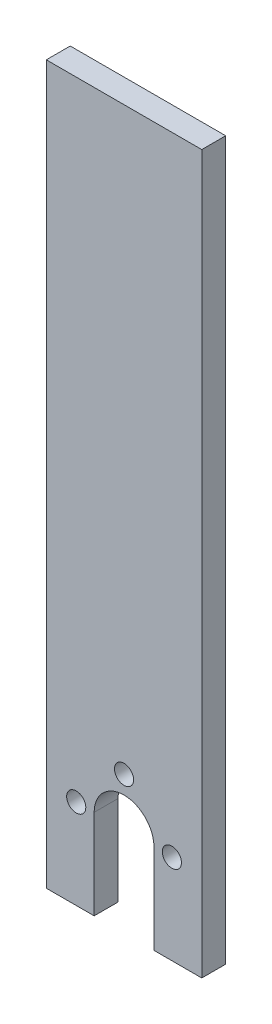
ISO-10303-21;
HEADER;
FILE_DESCRIPTION(('STEP AP214'),'2;1');
FILE_NAME('part.step','',(''),(''),'','','');
FILE_SCHEMA(('AUTOMOTIVE_DESIGN { 1 0 10303 214 1 1 1 1 }'));
ENDSEC;
DATA;
#1=APPLICATION_CONTEXT('core data for automotive mechanical design processes');
#2=APPLICATION_PROTOCOL_DEFINITION('international standard','automotive_design',2000,#1);
#3=PRODUCT_CONTEXT('',#1,'mechanical');
#4=PRODUCT('Part','Part','',(#3));
#5=PRODUCT_RELATED_PRODUCT_CATEGORY('part','',(#4));
#6=PRODUCT_DEFINITION_FORMATION('','',#4);
#7=PRODUCT_DEFINITION_CONTEXT('part definition',#1,'design');
#8=PRODUCT_DEFINITION('design','',#6,#7);
#9=PRODUCT_DEFINITION_SHAPE('','',#8);
#10=(LENGTH_UNIT() NAMED_UNIT(*) SI_UNIT(.MILLI.,.METRE.));
#11=(NAMED_UNIT(*) PLANE_ANGLE_UNIT() SI_UNIT($,.RADIAN.));
#12=(NAMED_UNIT(*) SI_UNIT($,.STERADIAN.) SOLID_ANGLE_UNIT());
#13=UNCERTAINTY_MEASURE_WITH_UNIT(LENGTH_MEASURE(1.E-05),#10,'distance_accuracy_value','');
#14=(GEOMETRIC_REPRESENTATION_CONTEXT(3) GLOBAL_UNCERTAINTY_ASSIGNED_CONTEXT((#13)) GLOBAL_UNIT_ASSIGNED_CONTEXT((#10,
#11,#12)) REPRESENTATION_CONTEXT('',''));
#15=CARTESIAN_POINT('',(0.,0.,0.));
#16=DIRECTION('',(0.,0.,1.));
#17=DIRECTION('',(1.,0.,0.));
#18=AXIS2_PLACEMENT_3D('',#15,#16,#17);
#19=CARTESIAN_POINT('',(0.,0.,4.));
#20=DIRECTION('',(0.,0.,1.));
#21=DIRECTION('',(1.,0.,0.));
#22=AXIS2_PLACEMENT_3D('',#19,#20,#21);
#23=PLANE('',#22);
#24=CARTESIAN_POINT('',(-8.,0.,4.));
#25=DIRECTION('',(0.,0.,1.));
#26=DIRECTION('',(-1.,0.,0.));
#27=AXIS2_PLACEMENT_3D('',#24,#25,#26);
#28=CIRCLE('',#27,1.6);
#29=CARTESIAN_POINT('',(-9.6,0.,4.));
#30=VERTEX_POINT('',#29);
#31=EDGE_CURVE('E187',#30,#30,#28,.T.);
#32=ORIENTED_EDGE('',*,*,#31,.F.);
#33=EDGE_LOOP('',(#32));
#34=FACE_BOUND('',#33,.T.);
#35=DIRECTION('',(1.,0.,0.));
#36=VECTOR('',#35,1.);
#37=CARTESIAN_POINT('',(-5.,-15.,4.));
#38=LINE('',#37,#36);
#39=CARTESIAN_POINT('',(-13.,-15.,4.));
#40=VERTEX_POINT('',#39);
#41=CARTESIAN_POINT('',(-5.,-15.,4.));
#42=VERTEX_POINT('',#41);
#43=EDGE_CURVE('E152',#40,#42,#38,.T.);
#44=ORIENTED_EDGE('',*,*,#43,.T.);
#45=DIRECTION('',(0.,1.,0.));
#46=VECTOR('',#45,1.);
#47=CARTESIAN_POINT('',(-5.,0.,4.));
#48=LINE('',#47,#46);
#49=CARTESIAN_POINT('',(-5.,0.,4.));
#50=VERTEX_POINT('',#49);
#51=EDGE_CURVE('E95',#42,#50,#48,.T.);
#52=ORIENTED_EDGE('',*,*,#51,.T.);
#53=CARTESIAN_POINT('',(0.,0.,4.));
#54=DIRECTION('',(0.,0.,-1.));
#55=DIRECTION('',(1.,0.,0.));
#56=AXIS2_PLACEMENT_3D('',#53,#54,#55);
#57=CIRCLE('',#56,5.);
#58=CARTESIAN_POINT('',(5.,0.,4.));
#59=VERTEX_POINT('',#58);
#60=EDGE_CURVE('E167',#50,#59,#57,.T.);
#61=ORIENTED_EDGE('',*,*,#60,.T.);
#62=DIRECTION('',(0.,-1.,0.));
#63=VECTOR('',#62,1.);
#64=CARTESIAN_POINT('',(5.,0.,4.));
#65=LINE('',#64,#63);
#66=CARTESIAN_POINT('',(5.,-15.,4.));
#67=VERTEX_POINT('',#66);
#68=EDGE_CURVE('E178',#59,#67,#65,.T.);
#69=ORIENTED_EDGE('',*,*,#68,.T.);
#70=DIRECTION('',(1.,0.,0.));
#71=VECTOR('',#70,1.);
#72=CARTESIAN_POINT('',(5.,-15.,4.));
#73=LINE('',#72,#71);
#74=CARTESIAN_POINT('',(13.,-15.,4.));
#75=VERTEX_POINT('',#74);
#76=EDGE_CURVE('E115',#67,#75,#73,.T.);
#77=ORIENTED_EDGE('',*,*,#76,.T.);
#78=DIRECTION('',(0.,1.,0.));
#79=VECTOR('',#78,1.);
#80=CARTESIAN_POINT('',(13.,-15.,4.));
#81=LINE('',#80,#79);
#82=CARTESIAN_POINT('',(13.,105.,4.));
#83=VERTEX_POINT('',#82);
#84=EDGE_CURVE('E108',#75,#83,#81,.T.);
#85=ORIENTED_EDGE('',*,*,#84,.T.);
#86=DIRECTION('',(-1.,0.,0.));
#87=VECTOR('',#86,1.);
#88=CARTESIAN_POINT('',(13.,105.,4.));
#89=LINE('',#88,#87);
#90=CARTESIAN_POINT('',(-13.,105.,4.));
#91=VERTEX_POINT('',#90);
#92=EDGE_CURVE('E112',#83,#91,#89,.T.);
#93=ORIENTED_EDGE('',*,*,#92,.T.);
#94=DIRECTION('',(0.,-1.,0.));
#95=VECTOR('',#94,1.);
#96=CARTESIAN_POINT('',(-13.,-12.,4.));
#97=LINE('',#96,#95);
#98=EDGE_CURVE('E54',#91,#40,#97,.T.);
#99=ORIENTED_EDGE('',*,*,#98,.T.);
#100=EDGE_LOOP('',(#44,#52,#61,#69,#77,#85,#93,#99));
#101=FACE_BOUND('',#100,.T.);
#102=CARTESIAN_POINT('',(8.,0.,4.));
#103=DIRECTION('',(0.,0.,1.));
#104=DIRECTION('',(1.,0.,0.));
#105=AXIS2_PLACEMENT_3D('',#102,#103,#104);
#106=CIRCLE('',#105,1.6);
#107=CARTESIAN_POINT('',(9.6,0.,4.));
#108=VERTEX_POINT('',#107);
#109=EDGE_CURVE('E138',#108,#108,#106,.T.);
#110=ORIENTED_EDGE('',*,*,#109,.F.);
#111=EDGE_LOOP('',(#110));
#112=FACE_BOUND('',#111,.T.);
#113=CARTESIAN_POINT('',(0.,8.,4.));
#114=DIRECTION('',(0.,0.,1.));
#115=DIRECTION('',(1.,0.,0.));
#116=AXIS2_PLACEMENT_3D('',#113,#114,#115);
#117=CIRCLE('',#116,1.6);
#118=CARTESIAN_POINT('',(1.6,8.,4.));
#119=VERTEX_POINT('',#118);
#120=EDGE_CURVE('E193',#119,#119,#117,.T.);
#121=ORIENTED_EDGE('',*,*,#120,.F.);
#122=EDGE_LOOP('',(#121));
#123=FACE_BOUND('',#122,.T.);
#124=ADVANCED_FACE('F37',(#34,#101,#112,#123),#23,.T.);
#125=CARTESIAN_POINT('',(0.,0.,0.));
#126=DIRECTION('',(0.,0.,1.));
#127=DIRECTION('',(1.,0.,0.));
#128=AXIS2_PLACEMENT_3D('',#125,#126,#127);
#129=PLANE('',#128);
#130=DIRECTION('',(0.,1.,0.));
#131=VECTOR('',#130,1.);
#132=CARTESIAN_POINT('',(-5.,0.,0.));
#133=LINE('',#132,#131);
#134=CARTESIAN_POINT('',(-5.,-15.,0.));
#135=VERTEX_POINT('',#134);
#136=CARTESIAN_POINT('',(-5.,0.,0.));
#137=VERTEX_POINT('',#136);
#138=EDGE_CURVE('E135',#135,#137,#133,.T.);
#139=ORIENTED_EDGE('',*,*,#138,.F.);
#140=DIRECTION('',(1.,0.,0.));
#141=VECTOR('',#140,1.);
#142=CARTESIAN_POINT('',(-8.,-15.,0.));
#143=LINE('',#142,#141);
#144=CARTESIAN_POINT('',(-13.,-15.,0.));
#145=VERTEX_POINT('',#144);
#146=EDGE_CURVE('E150',#145,#135,#143,.T.);
#147=ORIENTED_EDGE('',*,*,#146,.F.);
#148=DIRECTION('',(0.,-1.,0.));
#149=VECTOR('',#148,1.);
#150=CARTESIAN_POINT('',(-13.,-15.,0.));
#151=LINE('',#150,#149);
#152=CARTESIAN_POINT('',(-13.,105.,0.));
#153=VERTEX_POINT('',#152);
#154=EDGE_CURVE('E82',#153,#145,#151,.T.);
#155=ORIENTED_EDGE('',*,*,#154,.F.);
#156=DIRECTION('',(-1.,0.,0.));
#157=VECTOR('',#156,1.);
#158=CARTESIAN_POINT('',(-13.,105.,0.));
#159=LINE('',#158,#157);
#160=CARTESIAN_POINT('',(13.,105.,0.));
#161=VERTEX_POINT('',#160);
#162=EDGE_CURVE('E147',#161,#153,#159,.T.);
#163=ORIENTED_EDGE('',*,*,#162,.F.);
#164=DIRECTION('',(0.,1.,0.));
#165=VECTOR('',#164,1.);
#166=CARTESIAN_POINT('',(13.,-12.,0.));
#167=LINE('',#166,#165);
#168=CARTESIAN_POINT('',(13.,-15.,0.));
#169=VERTEX_POINT('',#168);
#170=EDGE_CURVE('E124',#169,#161,#167,.T.);
#171=ORIENTED_EDGE('',*,*,#170,.F.);
#172=DIRECTION('',(1.,0.,0.));
#173=VECTOR('',#172,1.);
#174=CARTESIAN_POINT('',(8.,-15.,0.));
#175=LINE('',#174,#173);
#176=CARTESIAN_POINT('',(5.,-15.,0.));
#177=VERTEX_POINT('',#176);
#178=EDGE_CURVE('E143',#177,#169,#175,.T.);
#179=ORIENTED_EDGE('',*,*,#178,.F.);
#180=DIRECTION('',(0.,-1.,0.));
#181=VECTOR('',#180,1.);
#182=CARTESIAN_POINT('',(5.,0.,0.));
#183=LINE('',#182,#181);
#184=CARTESIAN_POINT('',(5.,0.,0.));
#185=VERTEX_POINT('',#184);
#186=EDGE_CURVE('E140',#185,#177,#183,.T.);
#187=ORIENTED_EDGE('',*,*,#186,.F.);
#188=CARTESIAN_POINT('',(0.,0.,0.));
#189=DIRECTION('',(0.,0.,-1.));
#190=DIRECTION('',(1.,0.,0.));
#191=AXIS2_PLACEMENT_3D('',#188,#189,#190);
#192=CIRCLE('',#191,5.);
#193=EDGE_CURVE('E137',#137,#185,#192,.T.);
#194=ORIENTED_EDGE('',*,*,#193,.F.);
#195=EDGE_LOOP('',(#139,#147,#155,#163,#171,#179,#187,#194));
#196=FACE_BOUND('',#195,.T.);
#197=CARTESIAN_POINT('',(8.,0.,0.));
#198=DIRECTION('',(0.,0.,1.));
#199=DIRECTION('',(1.,0.,0.));
#200=AXIS2_PLACEMENT_3D('',#197,#198,#199);
#201=CIRCLE('',#200,1.6);
#202=CARTESIAN_POINT('',(9.6,0.,0.));
#203=VERTEX_POINT('',#202);
#204=EDGE_CURVE('E184',#203,#203,#201,.T.);
#205=ORIENTED_EDGE('',*,*,#204,.T.);
#206=EDGE_LOOP('',(#205));
#207=FACE_BOUND('',#206,.T.);
#208=CARTESIAN_POINT('',(-8.,0.,0.));
#209=DIRECTION('',(0.,0.,1.));
#210=DIRECTION('',(-1.,0.,0.));
#211=AXIS2_PLACEMENT_3D('',#208,#209,#210);
#212=CIRCLE('',#211,1.6);
#213=CARTESIAN_POINT('',(-9.6,0.,0.));
#214=VERTEX_POINT('',#213);
#215=EDGE_CURVE('E190',#214,#214,#212,.T.);
#216=ORIENTED_EDGE('',*,*,#215,.T.);
#217=EDGE_LOOP('',(#216));
#218=FACE_BOUND('',#217,.T.);
#219=CARTESIAN_POINT('',(0.,8.,0.));
#220=DIRECTION('',(0.,0.,1.));
#221=DIRECTION('',(1.,0.,0.));
#222=AXIS2_PLACEMENT_3D('',#219,#220,#221);
#223=CIRCLE('',#222,1.6);
#224=CARTESIAN_POINT('',(1.6,8.,0.));
#225=VERTEX_POINT('',#224);
#226=EDGE_CURVE('E196',#225,#225,#223,.T.);
#227=ORIENTED_EDGE('',*,*,#226,.T.);
#228=EDGE_LOOP('',(#227));
#229=FACE_BOUND('',#228,.T.);
#230=ADVANCED_FACE('F170',(#196,#207,#218,#229),#129,.F.);
#231=CARTESIAN_POINT('',(-5.,0.,4.));
#232=DIRECTION('',(-1.,0.,0.));
#233=DIRECTION('',(0.,0.,1.));
#234=AXIS2_PLACEMENT_3D('',#231,#232,#233);
#235=PLANE('',#234);
#236=ORIENTED_EDGE('',*,*,#138,.T.);
#237=DIRECTION('',(0.,0.,-1.));
#238=VECTOR('',#237,1.);
#239=CARTESIAN_POINT('',(-5.,0.,4.));
#240=LINE('',#239,#238);
#241=EDGE_CURVE('E46',#50,#137,#240,.T.);
#242=ORIENTED_EDGE('',*,*,#241,.F.);
#243=ORIENTED_EDGE('',*,*,#51,.F.);
#244=DIRECTION('',(0.,0.,-1.));
#245=VECTOR('',#244,1.);
#246=CARTESIAN_POINT('',(-5.,-15.,4.));
#247=LINE('',#246,#245);
#248=EDGE_CURVE('E11',#42,#135,#247,.T.);
#249=ORIENTED_EDGE('',*,*,#248,.T.);
#250=EDGE_LOOP('',(#236,#242,#243,#249));
#251=FACE_BOUND('',#250,.T.);
#252=ADVANCED_FACE('F39',(#251),#235,.F.);
#253=CARTESIAN_POINT('',(0.,0.,4.));
#254=DIRECTION('',(0.,0.,-1.));
#255=DIRECTION('',(-1.,0.,0.));
#256=AXIS2_PLACEMENT_3D('',#253,#254,#255);
#257=CYLINDRICAL_SURFACE('',#256,5.);
#258=ORIENTED_EDGE('',*,*,#193,.T.);
#259=DIRECTION('',(0.,0.,-1.));
#260=VECTOR('',#259,1.);
#261=CARTESIAN_POINT('',(5.,0.,4.));
#262=LINE('',#261,#260);
#263=EDGE_CURVE('E159',#59,#185,#262,.T.);
#264=ORIENTED_EDGE('',*,*,#263,.F.);
#265=ORIENTED_EDGE('',*,*,#60,.F.);
#266=ORIENTED_EDGE('',*,*,#241,.T.);
#267=EDGE_LOOP('',(#258,#264,#265,#266));
#268=FACE_BOUND('',#267,.T.);
#269=ADVANCED_FACE('F165',(#268),#257,.F.);
#270=CARTESIAN_POINT('',(5.,0.,4.));
#271=DIRECTION('',(1.,0.,0.));
#272=DIRECTION('',(0.,0.,-1.));
#273=AXIS2_PLACEMENT_3D('',#270,#271,#272);
#274=PLANE('',#273);
#275=ORIENTED_EDGE('',*,*,#186,.T.);
#276=DIRECTION('',(0.,0.,-1.));
#277=VECTOR('',#276,1.);
#278=CARTESIAN_POINT('',(5.,-15.,4.));
#279=LINE('',#278,#277);
#280=EDGE_CURVE('E156',#67,#177,#279,.T.);
#281=ORIENTED_EDGE('',*,*,#280,.F.);
#282=ORIENTED_EDGE('',*,*,#68,.F.);
#283=ORIENTED_EDGE('',*,*,#263,.T.);
#284=EDGE_LOOP('',(#275,#281,#282,#283));
#285=FACE_BOUND('',#284,.T.);
#286=ADVANCED_FACE('F174',(#285),#274,.F.);
#287=CARTESIAN_POINT('',(8.,-15.,4.));
#288=DIRECTION('',(0.,1.,0.));
#289=DIRECTION('',(-1.,0.,0.));
#290=AXIS2_PLACEMENT_3D('',#287,#288,#289);
#291=PLANE('',#290);
#292=ORIENTED_EDGE('',*,*,#178,.T.);
#293=DIRECTION('',(0.,0.,-1.));
#294=VECTOR('',#293,1.);
#295=CARTESIAN_POINT('',(13.,-15.,4.));
#296=LINE('',#295,#294);
#297=EDGE_CURVE('E126',#75,#169,#296,.T.);
#298=ORIENTED_EDGE('',*,*,#297,.F.);
#299=ORIENTED_EDGE('',*,*,#76,.F.);
#300=ORIENTED_EDGE('',*,*,#280,.T.);
#301=EDGE_LOOP('',(#292,#298,#299,#300));
#302=FACE_BOUND('',#301,.T.);
#303=ADVANCED_FACE('F177',(#302),#291,.F.);
#304=CARTESIAN_POINT('',(13.,-12.,4.));
#305=DIRECTION('',(-1.,0.,0.));
#306=DIRECTION('',(0.,0.,1.));
#307=AXIS2_PLACEMENT_3D('',#304,#305,#306);
#308=PLANE('',#307);
#309=ORIENTED_EDGE('',*,*,#170,.T.);
#310=DIRECTION('',(0.,0.,-1.));
#311=VECTOR('',#310,1.);
#312=CARTESIAN_POINT('',(13.,105.,4.));
#313=LINE('',#312,#311);
#314=EDGE_CURVE('E122',#83,#161,#313,.T.);
#315=ORIENTED_EDGE('',*,*,#314,.F.);
#316=ORIENTED_EDGE('',*,*,#84,.F.);
#317=ORIENTED_EDGE('',*,*,#297,.T.);
#318=EDGE_LOOP('',(#309,#315,#316,#317));
#319=FACE_BOUND('',#318,.T.);
#320=ADVANCED_FACE('F123',(#319),#308,.F.);
#321=CARTESIAN_POINT('',(-13.,105.,4.));
#322=DIRECTION('',(0.,-1.,0.));
#323=DIRECTION('',(0.,0.,-1.));
#324=AXIS2_PLACEMENT_3D('',#321,#322,#323);
#325=PLANE('',#324);
#326=ORIENTED_EDGE('',*,*,#162,.T.);
#327=DIRECTION('',(0.,0.,-1.));
#328=VECTOR('',#327,1.);
#329=CARTESIAN_POINT('',(-13.,105.,4.));
#330=LINE('',#329,#328);
#331=EDGE_CURVE('E127',#91,#153,#330,.T.);
#332=ORIENTED_EDGE('',*,*,#331,.F.);
#333=ORIENTED_EDGE('',*,*,#92,.F.);
#334=ORIENTED_EDGE('',*,*,#314,.T.);
#335=EDGE_LOOP('',(#326,#332,#333,#334));
#336=FACE_BOUND('',#335,.T.);
#337=ADVANCED_FACE('F129',(#336),#325,.F.);
#338=CARTESIAN_POINT('',(-13.,-15.,4.));
#339=DIRECTION('',(1.,0.,0.));
#340=DIRECTION('',(0.,0.,-1.));
#341=AXIS2_PLACEMENT_3D('',#338,#339,#340);
#342=PLANE('',#341);
#343=ORIENTED_EDGE('',*,*,#154,.T.);
#344=DIRECTION('',(0.,0.,-1.));
#345=VECTOR('',#344,1.);
#346=CARTESIAN_POINT('',(-13.,-15.,4.));
#347=LINE('',#346,#345);
#348=EDGE_CURVE('E131',#40,#145,#347,.T.);
#349=ORIENTED_EDGE('',*,*,#348,.F.);
#350=ORIENTED_EDGE('',*,*,#98,.F.);
#351=ORIENTED_EDGE('',*,*,#331,.T.);
#352=EDGE_LOOP('',(#343,#349,#350,#351));
#353=FACE_BOUND('',#352,.T.);
#354=ADVANCED_FACE('F220',(#353),#342,.F.);
#355=CARTESIAN_POINT('',(-8.,-15.,4.));
#356=DIRECTION('',(0.,1.,0.));
#357=DIRECTION('',(-1.,0.,0.));
#358=AXIS2_PLACEMENT_3D('',#355,#356,#357);
#359=PLANE('',#358);
#360=ORIENTED_EDGE('',*,*,#146,.T.);
#361=ORIENTED_EDGE('',*,*,#248,.F.);
#362=ORIENTED_EDGE('',*,*,#43,.F.);
#363=ORIENTED_EDGE('',*,*,#348,.T.);
#364=EDGE_LOOP('',(#360,#361,#362,#363));
#365=FACE_BOUND('',#364,.T.);
#366=ADVANCED_FACE('F217',(#365),#359,.F.);
#367=CARTESIAN_POINT('',(8.,0.,4.));
#368=DIRECTION('',(0.,0.,-1.));
#369=DIRECTION('',(-1.,0.,0.));
#370=AXIS2_PLACEMENT_3D('',#367,#368,#369);
#371=CYLINDRICAL_SURFACE('',#370,1.6);
#372=ORIENTED_EDGE('',*,*,#109,.T.);
#373=EDGE_LOOP('',(#372));
#374=FACE_BOUND('',#373,.T.);
#375=ORIENTED_EDGE('',*,*,#204,.F.);
#376=EDGE_LOOP('',(#375));
#377=FACE_BOUND('',#376,.T.);
#378=ADVANCED_FACE('F214',(#374,#377),#371,.F.);
#379=CARTESIAN_POINT('',(-8.,0.,4.));
#380=DIRECTION('',(0.,0.,-1.));
#381=DIRECTION('',(-1.,0.,0.));
#382=AXIS2_PLACEMENT_3D('',#379,#380,#381);
#383=CYLINDRICAL_SURFACE('',#382,1.6);
#384=ORIENTED_EDGE('',*,*,#31,.T.);
#385=EDGE_LOOP('',(#384));
#386=FACE_BOUND('',#385,.T.);
#387=ORIENTED_EDGE('',*,*,#215,.F.);
#388=EDGE_LOOP('',(#387));
#389=FACE_BOUND('',#388,.T.);
#390=ADVANCED_FACE('F305',(#386,#389),#383,.F.);
#391=CARTESIAN_POINT('',(0.,8.,4.));
#392=DIRECTION('',(0.,0.,-1.));
#393=DIRECTION('',(-1.,0.,0.));
#394=AXIS2_PLACEMENT_3D('',#391,#392,#393);
#395=CYLINDRICAL_SURFACE('',#394,1.6);
#396=ORIENTED_EDGE('',*,*,#120,.T.);
#397=EDGE_LOOP('',(#396));
#398=FACE_BOUND('',#397,.T.);
#399=ORIENTED_EDGE('',*,*,#226,.F.);
#400=EDGE_LOOP('',(#399));
#401=FACE_BOUND('',#400,.T.);
#402=ADVANCED_FACE('F202',(#398,#401),#395,.F.);
#403=CLOSED_SHELL('',(#124,#230,#252,#269,#286,#303,#320,#337,#354,#366,#378,#390,#402));
#404=MANIFOLD_SOLID_BREP('B2',#403);
#405=ADVANCED_BREP_SHAPE_REPRESENTATION('',(#18,#404),#14);
#406=SHAPE_DEFINITION_REPRESENTATION(#9,#405);
ENDSEC;
END-ISO-10303-21;
